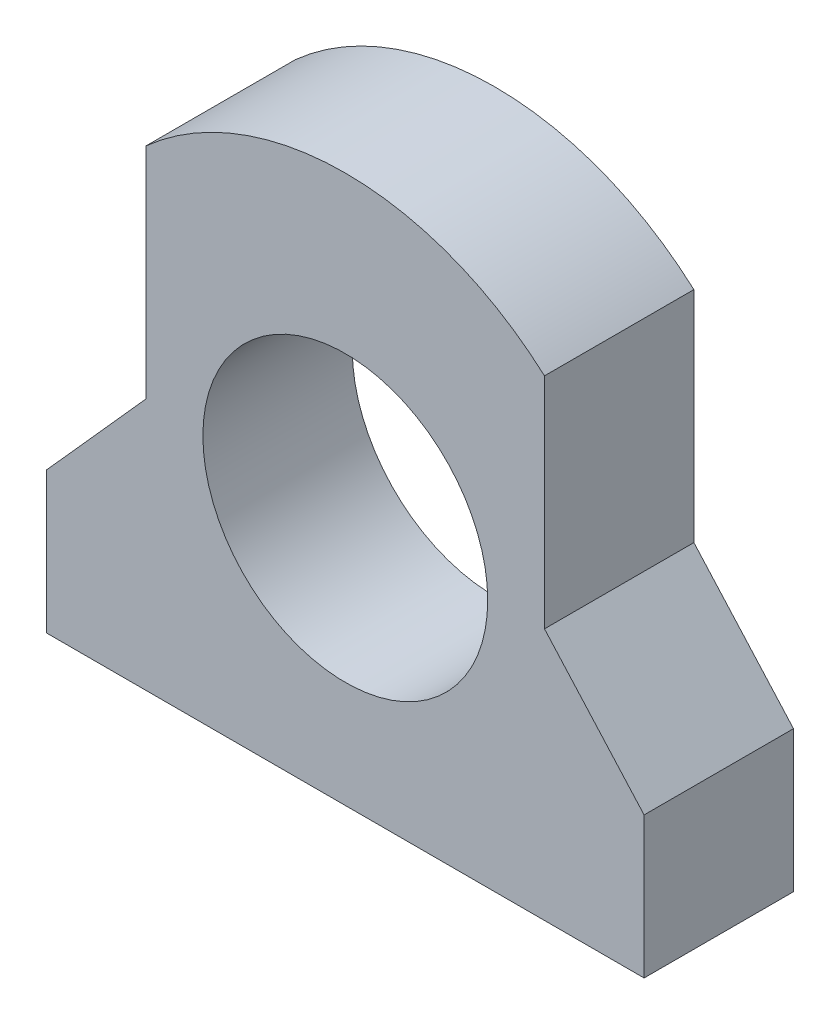
ISO-10303-21;
HEADER;
FILE_DESCRIPTION(('STEP AP214'),'2;1');
FILE_NAME('part.step','',(''),(''),'','','');
FILE_SCHEMA(('AUTOMOTIVE_DESIGN { 1 0 10303 214 1 1 1 1 }'));
ENDSEC;
DATA;
#1=APPLICATION_CONTEXT('core data for automotive mechanical design processes');
#2=APPLICATION_PROTOCOL_DEFINITION('international standard','automotive_design',2000,#1);
#3=PRODUCT_CONTEXT('',#1,'mechanical');
#4=PRODUCT('Part','Part','',(#3));
#5=PRODUCT_RELATED_PRODUCT_CATEGORY('part','',(#4));
#6=PRODUCT_DEFINITION_FORMATION('','',#4);
#7=PRODUCT_DEFINITION_CONTEXT('part definition',#1,'design');
#8=PRODUCT_DEFINITION('design','',#6,#7);
#9=PRODUCT_DEFINITION_SHAPE('','',#8);
#10=(LENGTH_UNIT() NAMED_UNIT(*) SI_UNIT(.MILLI.,.METRE.));
#11=(NAMED_UNIT(*) PLANE_ANGLE_UNIT() SI_UNIT($,.RADIAN.));
#12=(NAMED_UNIT(*) SI_UNIT($,.STERADIAN.) SOLID_ANGLE_UNIT());
#13=UNCERTAINTY_MEASURE_WITH_UNIT(LENGTH_MEASURE(1.E-05),#10,'distance_accuracy_value','');
#14=(GEOMETRIC_REPRESENTATION_CONTEXT(3) GLOBAL_UNCERTAINTY_ASSIGNED_CONTEXT((#13)) GLOBAL_UNIT_ASSIGNED_CONTEXT((#10,
#11,#12)) REPRESENTATION_CONTEXT('',''));
#15=CARTESIAN_POINT('',(0.,0.,0.));
#16=DIRECTION('',(0.,0.,1.));
#17=DIRECTION('',(1.,0.,0.));
#18=AXIS2_PLACEMENT_3D('',#15,#16,#17);
#19=CARTESIAN_POINT('',(0.,25.,15.));
#20=DIRECTION('',(0.,0.,-1.));
#21=DIRECTION('',(-1.,0.,0.));
#22=AXIS2_PLACEMENT_3D('',#19,#20,#21);
#23=PLANE('',#22);
#24=DIRECTION('',(0.,-1.,0.));
#25=VECTOR('',#24,1.);
#26=CARTESIAN_POINT('',(-30.,0.,15.));
#27=LINE('',#26,#25);
#28=CARTESIAN_POINT('',(-30.,14.1803398874989,15.));
#29=VERTEX_POINT('',#28);
#30=CARTESIAN_POINT('',(-30.,0.,15.));
#31=VERTEX_POINT('',#30);
#32=EDGE_CURVE('E145',#29,#31,#27,.T.);
#33=ORIENTED_EDGE('',*,*,#32,.T.);
#34=DIRECTION('',(1.,0.,0.));
#35=VECTOR('',#34,1.);
#36=CARTESIAN_POINT('',(-30.,0.,15.));
#37=LINE('',#36,#35);
#38=CARTESIAN_POINT('',(30.,0.,15.));
#39=VERTEX_POINT('',#38);
#40=EDGE_CURVE('E93',#31,#39,#37,.T.);
#41=ORIENTED_EDGE('',*,*,#40,.T.);
#42=DIRECTION('',(0.,1.,0.));
#43=VECTOR('',#42,1.);
#44=CARTESIAN_POINT('',(30.,0.,15.));
#45=LINE('',#44,#43);
#46=CARTESIAN_POINT('',(30.,14.1803398874989,15.));
#47=VERTEX_POINT('',#46);
#48=EDGE_CURVE('E160',#39,#47,#45,.T.);
#49=ORIENTED_EDGE('',*,*,#48,.T.);
#50=DIRECTION('',(-0.666666666666667,0.745355992499929,0.));
#51=VECTOR('',#50,1.);
#52=CARTESIAN_POINT('',(30.,14.1803398874989,15.));
#53=LINE('',#52,#51);
#54=CARTESIAN_POINT('',(20.,25.3606797749979,15.));
#55=VERTEX_POINT('',#54);
#56=EDGE_CURVE('E173',#47,#55,#53,.T.);
#57=ORIENTED_EDGE('',*,*,#56,.T.);
#58=DIRECTION('',(0.,1.,0.));
#59=VECTOR('',#58,1.);
#60=CARTESIAN_POINT('',(20.,25.3606797749979,15.));
#61=LINE('',#60,#59);
#62=CARTESIAN_POINT('',(20.,47.3606797749979,15.));
#63=VERTEX_POINT('',#62);
#64=EDGE_CURVE('E112',#55,#63,#61,.T.);
#65=ORIENTED_EDGE('',*,*,#64,.T.);
#66=CARTESIAN_POINT('',(0.,25.,15.));
#67=DIRECTION('',(0.,0.,1.));
#68=DIRECTION('',(-1.,0.,0.));
#69=AXIS2_PLACEMENT_3D('',#66,#67,#68);
#70=CIRCLE('',#69,30.);
#71=CARTESIAN_POINT('',(-20.,47.3606797749979,15.));
#72=VERTEX_POINT('',#71);
#73=EDGE_CURVE('E106',#63,#72,#70,.T.);
#74=ORIENTED_EDGE('',*,*,#73,.T.);
#75=DIRECTION('',(0.,-1.,0.));
#76=VECTOR('',#75,1.);
#77=CARTESIAN_POINT('',(-20.,25.3606797749979,15.));
#78=LINE('',#77,#76);
#79=CARTESIAN_POINT('',(-20.,25.3606797749979,15.));
#80=VERTEX_POINT('',#79);
#81=EDGE_CURVE('E110',#72,#80,#78,.T.);
#82=ORIENTED_EDGE('',*,*,#81,.T.);
#83=DIRECTION('',(-0.666666666666666,-0.74535599249993,0.));
#84=VECTOR('',#83,1.);
#85=CARTESIAN_POINT('',(-30.,14.1803398874989,15.));
#86=LINE('',#85,#84);
#87=EDGE_CURVE('E50',#80,#29,#86,.T.);
#88=ORIENTED_EDGE('',*,*,#87,.T.);
#89=EDGE_LOOP('',(#33,#41,#49,#57,#65,#74,#82,#88));
#90=FACE_BOUND('',#89,.T.);
#91=CARTESIAN_POINT('',(0.,25.,15.));
#92=DIRECTION('',(0.,0.,1.));
#93=DIRECTION('',(1.,0.,0.));
#94=AXIS2_PLACEMENT_3D('',#91,#92,#93);
#95=CIRCLE('',#94,14.3);
#96=CARTESIAN_POINT('',(14.3,25.,15.));
#97=VERTEX_POINT('',#96);
#98=EDGE_CURVE('E134',#97,#97,#95,.T.);
#99=ORIENTED_EDGE('',*,*,#98,.F.);
#100=EDGE_LOOP('',(#99));
#101=FACE_BOUND('',#100,.T.);
#102=ADVANCED_FACE('F33',(#90,#101),#23,.F.);
#103=CARTESIAN_POINT('',(0.,25.,0.));
#104=DIRECTION('',(0.,0.,-1.));
#105=DIRECTION('',(-1.,0.,0.));
#106=AXIS2_PLACEMENT_3D('',#103,#104,#105);
#107=PLANE('',#106);
#108=DIRECTION('',(0.,-1.,0.));
#109=VECTOR('',#108,1.);
#110=CARTESIAN_POINT('',(-30.,0.,0.));
#111=LINE('',#110,#109);
#112=CARTESIAN_POINT('',(-30.,14.1803398874989,0.));
#113=VERTEX_POINT('',#112);
#114=CARTESIAN_POINT('',(-30.,0.,0.));
#115=VERTEX_POINT('',#114);
#116=EDGE_CURVE('E130',#113,#115,#111,.T.);
#117=ORIENTED_EDGE('',*,*,#116,.F.);
#118=DIRECTION('',(-0.666666666666666,-0.74535599249993,0.));
#119=VECTOR('',#118,1.);
#120=CARTESIAN_POINT('',(-30.,14.1803398874989,0.));
#121=LINE('',#120,#119);
#122=CARTESIAN_POINT('',(-20.,25.3606797749979,0.));
#123=VERTEX_POINT('',#122);
#124=EDGE_CURVE('E85',#123,#113,#121,.T.);
#125=ORIENTED_EDGE('',*,*,#124,.F.);
#126=DIRECTION('',(0.,-1.,0.));
#127=VECTOR('',#126,1.);
#128=CARTESIAN_POINT('',(-20.,25.3606797749979,0.));
#129=LINE('',#128,#127);
#130=CARTESIAN_POINT('',(-20.,47.3606797749979,0.));
#131=VERTEX_POINT('',#130);
#132=EDGE_CURVE('E79',#131,#123,#129,.T.);
#133=ORIENTED_EDGE('',*,*,#132,.F.);
#134=CARTESIAN_POINT('',(0.,25.,0.));
#135=DIRECTION('',(0.,0.,1.));
#136=DIRECTION('',(-1.,0.,0.));
#137=AXIS2_PLACEMENT_3D('',#134,#135,#136);
#138=CIRCLE('',#137,30.);
#139=CARTESIAN_POINT('',(20.,47.3606797749979,0.));
#140=VERTEX_POINT('',#139);
#141=EDGE_CURVE('E120',#140,#131,#138,.T.);
#142=ORIENTED_EDGE('',*,*,#141,.F.);
#143=DIRECTION('',(0.,1.,0.));
#144=VECTOR('',#143,1.);
#145=CARTESIAN_POINT('',(20.,25.3606797749979,0.));
#146=LINE('',#145,#144);
#147=CARTESIAN_POINT('',(20.,25.3606797749979,0.));
#148=VERTEX_POINT('',#147);
#149=EDGE_CURVE('E140',#148,#140,#146,.T.);
#150=ORIENTED_EDGE('',*,*,#149,.F.);
#151=DIRECTION('',(-0.666666666666667,0.745355992499929,0.));
#152=VECTOR('',#151,1.);
#153=CARTESIAN_POINT('',(30.,14.1803398874989,0.));
#154=LINE('',#153,#152);
#155=CARTESIAN_POINT('',(30.,14.1803398874989,0.));
#156=VERTEX_POINT('',#155);
#157=EDGE_CURVE('E138',#156,#148,#154,.T.);
#158=ORIENTED_EDGE('',*,*,#157,.F.);
#159=DIRECTION('',(0.,1.,0.));
#160=VECTOR('',#159,1.);
#161=CARTESIAN_POINT('',(30.,0.,0.));
#162=LINE('',#161,#160);
#163=CARTESIAN_POINT('',(30.,0.,0.));
#164=VERTEX_POINT('',#163);
#165=EDGE_CURVE('E136',#164,#156,#162,.T.);
#166=ORIENTED_EDGE('',*,*,#165,.F.);
#167=DIRECTION('',(1.,0.,0.));
#168=VECTOR('',#167,1.);
#169=CARTESIAN_POINT('',(-30.,0.,0.));
#170=LINE('',#169,#168);
#171=EDGE_CURVE('E133',#115,#164,#170,.T.);
#172=ORIENTED_EDGE('',*,*,#171,.F.);
#173=EDGE_LOOP('',(#117,#125,#133,#142,#150,#158,#166,#172));
#174=FACE_BOUND('',#173,.T.);
#175=CARTESIAN_POINT('',(0.,25.,0.));
#176=DIRECTION('',(0.,0.,1.));
#177=DIRECTION('',(1.,0.,0.));
#178=AXIS2_PLACEMENT_3D('',#175,#176,#177);
#179=CIRCLE('',#178,14.3);
#180=CARTESIAN_POINT('',(14.3,25.,0.));
#181=VERTEX_POINT('',#180);
#182=EDGE_CURVE('E179',#181,#181,#179,.T.);
#183=ORIENTED_EDGE('',*,*,#182,.T.);
#184=EDGE_LOOP('',(#183));
#185=FACE_BOUND('',#184,.T.);
#186=ADVANCED_FACE('F164',(#174,#185),#107,.T.);
#187=CARTESIAN_POINT('',(-30.,0.,15.));
#188=DIRECTION('',(1.,0.,0.));
#189=DIRECTION('',(0.,0.,-1.));
#190=AXIS2_PLACEMENT_3D('',#187,#188,#189);
#191=PLANE('',#190);
#192=ORIENTED_EDGE('',*,*,#116,.T.);
#193=DIRECTION('',(0.,0.,-1.));
#194=VECTOR('',#193,1.);
#195=CARTESIAN_POINT('',(-30.,0.,15.));
#196=LINE('',#195,#194);
#197=EDGE_CURVE('E11',#31,#115,#196,.T.);
#198=ORIENTED_EDGE('',*,*,#197,.F.);
#199=ORIENTED_EDGE('',*,*,#32,.F.);
#200=DIRECTION('',(0.,0.,-1.));
#201=VECTOR('',#200,1.);
#202=CARTESIAN_POINT('',(-30.,14.1803398874989,15.));
#203=LINE('',#202,#201);
#204=EDGE_CURVE('E126',#29,#113,#203,.T.);
#205=ORIENTED_EDGE('',*,*,#204,.T.);
#206=EDGE_LOOP('',(#192,#198,#199,#205));
#207=FACE_BOUND('',#206,.T.);
#208=ADVANCED_FACE('F35',(#207),#191,.F.);
#209=CARTESIAN_POINT('',(-30.,0.,15.));
#210=DIRECTION('',(0.,1.,0.));
#211=DIRECTION('',(-1.,0.,0.));
#212=AXIS2_PLACEMENT_3D('',#209,#210,#211);
#213=PLANE('',#212);
#214=ORIENTED_EDGE('',*,*,#171,.T.);
#215=DIRECTION('',(0.,0.,-1.));
#216=VECTOR('',#215,1.);
#217=CARTESIAN_POINT('',(30.,0.,15.));
#218=LINE('',#217,#216);
#219=EDGE_CURVE('E42',#39,#164,#218,.T.);
#220=ORIENTED_EDGE('',*,*,#219,.F.);
#221=ORIENTED_EDGE('',*,*,#40,.F.);
#222=ORIENTED_EDGE('',*,*,#197,.T.);
#223=EDGE_LOOP('',(#214,#220,#221,#222));
#224=FACE_BOUND('',#223,.T.);
#225=ADVANCED_FACE('F207',(#224),#213,.F.);
#226=CARTESIAN_POINT('',(30.,0.,15.));
#227=DIRECTION('',(-1.,0.,0.));
#228=DIRECTION('',(0.,0.,1.));
#229=AXIS2_PLACEMENT_3D('',#226,#227,#228);
#230=PLANE('',#229);
#231=ORIENTED_EDGE('',*,*,#165,.T.);
#232=DIRECTION('',(0.,0.,-1.));
#233=VECTOR('',#232,1.);
#234=CARTESIAN_POINT('',(30.,14.1803398874989,15.));
#235=LINE('',#234,#233);
#236=EDGE_CURVE('E152',#47,#156,#235,.T.);
#237=ORIENTED_EDGE('',*,*,#236,.F.);
#238=ORIENTED_EDGE('',*,*,#48,.F.);
#239=ORIENTED_EDGE('',*,*,#219,.T.);
#240=EDGE_LOOP('',(#231,#237,#238,#239));
#241=FACE_BOUND('',#240,.T.);
#242=ADVANCED_FACE('F158',(#241),#230,.F.);
#243=CARTESIAN_POINT('',(30.,14.1803398874989,15.));
#244=DIRECTION('',(-0.745355992499929,-0.666666666666667,0.));
#245=DIRECTION('',(0.666666666666667,-0.745355992499929,0.));
#246=AXIS2_PLACEMENT_3D('',#243,#244,#245);
#247=PLANE('',#246);
#248=ORIENTED_EDGE('',*,*,#157,.T.);
#249=DIRECTION('',(0.,0.,-1.));
#250=VECTOR('',#249,1.);
#251=CARTESIAN_POINT('',(20.,25.3606797749979,15.));
#252=LINE('',#251,#250);
#253=EDGE_CURVE('E149',#55,#148,#252,.T.);
#254=ORIENTED_EDGE('',*,*,#253,.F.);
#255=ORIENTED_EDGE('',*,*,#56,.F.);
#256=ORIENTED_EDGE('',*,*,#236,.T.);
#257=EDGE_LOOP('',(#248,#254,#255,#256));
#258=FACE_BOUND('',#257,.T.);
#259=ADVANCED_FACE('F169',(#258),#247,.F.);
#260=CARTESIAN_POINT('',(20.,25.3606797749979,15.));
#261=DIRECTION('',(-1.,0.,0.));
#262=DIRECTION('',(0.,-1.,0.));
#263=AXIS2_PLACEMENT_3D('',#260,#261,#262);
#264=PLANE('',#263);
#265=ORIENTED_EDGE('',*,*,#149,.T.);
#266=DIRECTION('',(0.,0.,-1.));
#267=VECTOR('',#266,1.);
#268=CARTESIAN_POINT('',(20.,47.3606797749979,15.));
#269=LINE('',#268,#267);
#270=EDGE_CURVE('E121',#63,#140,#269,.T.);
#271=ORIENTED_EDGE('',*,*,#270,.F.);
#272=ORIENTED_EDGE('',*,*,#64,.F.);
#273=ORIENTED_EDGE('',*,*,#253,.T.);
#274=EDGE_LOOP('',(#265,#271,#272,#273));
#275=FACE_BOUND('',#274,.T.);
#276=ADVANCED_FACE('F172',(#275),#264,.F.);
#277=CARTESIAN_POINT('',(0.,25.,15.));
#278=DIRECTION('',(0.,0.,-1.));
#279=DIRECTION('',(-1.,0.,0.));
#280=AXIS2_PLACEMENT_3D('',#277,#278,#279);
#281=CYLINDRICAL_SURFACE('',#280,30.);
#282=ORIENTED_EDGE('',*,*,#141,.T.);
#283=DIRECTION('',(0.,0.,-1.));
#284=VECTOR('',#283,1.);
#285=CARTESIAN_POINT('',(-20.,47.3606797749979,15.));
#286=LINE('',#285,#284);
#287=EDGE_CURVE('E117',#72,#131,#286,.T.);
#288=ORIENTED_EDGE('',*,*,#287,.F.);
#289=ORIENTED_EDGE('',*,*,#73,.F.);
#290=ORIENTED_EDGE('',*,*,#270,.T.);
#291=EDGE_LOOP('',(#282,#288,#289,#290));
#292=FACE_BOUND('',#291,.T.);
#293=ADVANCED_FACE('F118',(#292),#281,.T.);
#294=CARTESIAN_POINT('',(-20.,25.3606797749979,15.));
#295=DIRECTION('',(1.,0.,0.));
#296=DIRECTION('',(0.,1.,0.));
#297=AXIS2_PLACEMENT_3D('',#294,#295,#296);
#298=PLANE('',#297);
#299=ORIENTED_EDGE('',*,*,#132,.T.);
#300=DIRECTION('',(0.,0.,-1.));
#301=VECTOR('',#300,1.);
#302=CARTESIAN_POINT('',(-20.,25.3606797749979,15.));
#303=LINE('',#302,#301);
#304=EDGE_CURVE('E122',#80,#123,#303,.T.);
#305=ORIENTED_EDGE('',*,*,#304,.F.);
#306=ORIENTED_EDGE('',*,*,#81,.F.);
#307=ORIENTED_EDGE('',*,*,#287,.T.);
#308=EDGE_LOOP('',(#299,#305,#306,#307));
#309=FACE_BOUND('',#308,.T.);
#310=ADVANCED_FACE('F124',(#309),#298,.F.);
#311=CARTESIAN_POINT('',(-30.,14.1803398874989,15.));
#312=DIRECTION('',(0.74535599249993,-0.666666666666666,0.));
#313=DIRECTION('',(0.666666666666666,0.74535599249993,0.));
#314=AXIS2_PLACEMENT_3D('',#311,#312,#313);
#315=PLANE('',#314);
#316=ORIENTED_EDGE('',*,*,#124,.T.);
#317=ORIENTED_EDGE('',*,*,#204,.F.);
#318=ORIENTED_EDGE('',*,*,#87,.F.);
#319=ORIENTED_EDGE('',*,*,#304,.T.);
#320=EDGE_LOOP('',(#316,#317,#318,#319));
#321=FACE_BOUND('',#320,.T.);
#322=ADVANCED_FACE('F195',(#321),#315,.F.);
#323=CARTESIAN_POINT('',(0.,25.,15.));
#324=DIRECTION('',(0.,0.,-1.));
#325=DIRECTION('',(-1.,0.,0.));
#326=AXIS2_PLACEMENT_3D('',#323,#324,#325);
#327=CYLINDRICAL_SURFACE('',#326,14.3);
#328=ORIENTED_EDGE('',*,*,#98,.T.);
#329=EDGE_LOOP('',(#328));
#330=FACE_BOUND('',#329,.T.);
#331=ORIENTED_EDGE('',*,*,#182,.F.);
#332=EDGE_LOOP('',(#331));
#333=FACE_BOUND('',#332,.T.);
#334=ADVANCED_FACE('F185',(#330,#333),#327,.F.);
#335=CLOSED_SHELL('',(#102,#186,#208,#225,#242,#259,#276,#293,#310,#322,#334));
#336=MANIFOLD_SOLID_BREP('B2',#335);
#337=ADVANCED_BREP_SHAPE_REPRESENTATION('',(#18,#336),#14);
#338=SHAPE_DEFINITION_REPRESENTATION(#9,#337);
ENDSEC;
END-ISO-10303-21;
